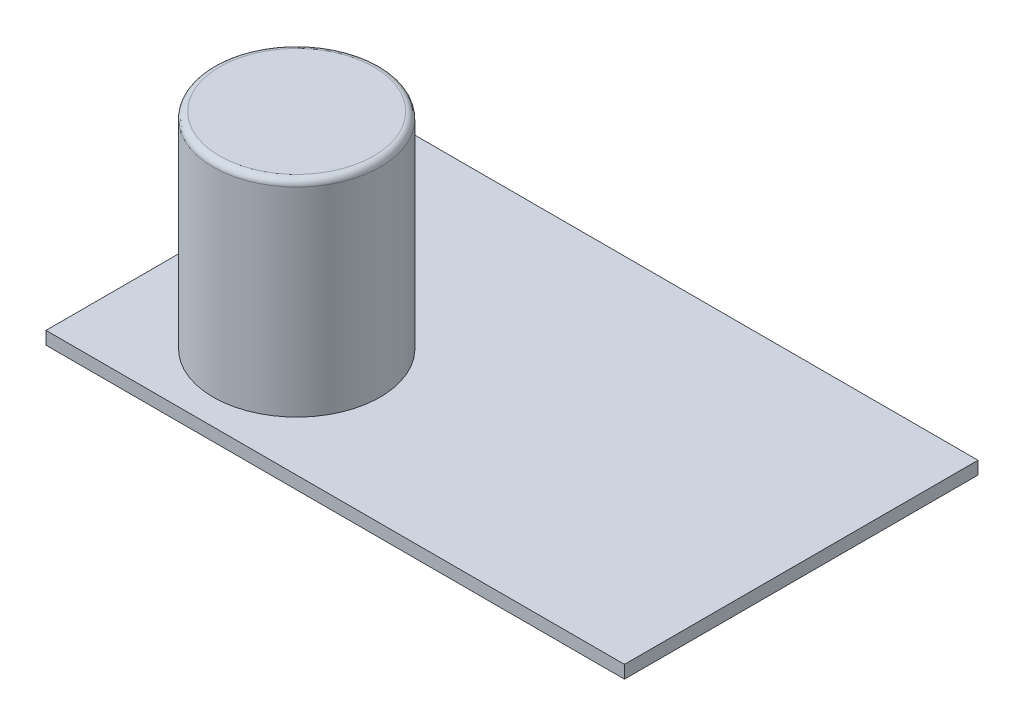
ISO-10303-21;
HEADER;
FILE_DESCRIPTION(('STEP AP214'),'2;1');
FILE_NAME('part.step','',(''),(''),'','','');
FILE_SCHEMA(('AUTOMOTIVE_DESIGN { 1 0 10303 214 1 1 1 1 }'));
ENDSEC;
DATA;
#1=APPLICATION_CONTEXT('core data for automotive mechanical design processes');
#2=APPLICATION_PROTOCOL_DEFINITION('international standard','automotive_design',2000,#1);
#3=PRODUCT_CONTEXT('',#1,'mechanical');
#4=PRODUCT('Part','Part','',(#3));
#5=PRODUCT_RELATED_PRODUCT_CATEGORY('part','',(#4));
#6=PRODUCT_DEFINITION_FORMATION('','',#4);
#7=PRODUCT_DEFINITION_CONTEXT('part definition',#1,'design');
#8=PRODUCT_DEFINITION('design','',#6,#7);
#9=PRODUCT_DEFINITION_SHAPE('','',#8);
#10=(LENGTH_UNIT() NAMED_UNIT(*) SI_UNIT(.MILLI.,.METRE.));
#11=(NAMED_UNIT(*) PLANE_ANGLE_UNIT() SI_UNIT($,.RADIAN.));
#12=(NAMED_UNIT(*) SI_UNIT($,.STERADIAN.) SOLID_ANGLE_UNIT());
#13=UNCERTAINTY_MEASURE_WITH_UNIT(LENGTH_MEASURE(1.E-05),#10,'distance_accuracy_value','');
#14=(GEOMETRIC_REPRESENTATION_CONTEXT(3) GLOBAL_UNCERTAINTY_ASSIGNED_CONTEXT((#13)) GLOBAL_UNIT_ASSIGNED_CONTEXT((#10,
#11,#12)) REPRESENTATION_CONTEXT('',''));
#15=CARTESIAN_POINT('',(0.,0.,0.));
#16=DIRECTION('',(0.,0.,1.));
#17=DIRECTION('',(1.,0.,0.));
#18=AXIS2_PLACEMENT_3D('',#15,#16,#17);
#19=CARTESIAN_POINT('',(11.,17.,-8.5));
#20=DIRECTION('',(0.,-1.,0.));
#21=DIRECTION('',(0.,0.,-1.));
#22=AXIS2_PLACEMENT_3D('',#19,#20,#21);
#23=CYLINDRICAL_SURFACE('',#22,6.5);
#24=CARTESIAN_POINT('',(11.,16.5,-8.5));
#25=DIRECTION('',(0.,1.,0.));
#26=DIRECTION('',(0.,0.,1.));
#27=AXIS2_PLACEMENT_3D('',#24,#25,#26);
#28=CIRCLE('',#27,6.5);
#29=CARTESIAN_POINT('',(11.,16.5,-2.));
#30=VERTEX_POINT('',#29);
#31=EDGE_CURVE('E11',#30,#30,#28,.F.);
#32=ORIENTED_EDGE('',*,*,#31,.T.);
#33=EDGE_LOOP('',(#32));
#34=FACE_BOUND('',#33,.T.);
#35=CARTESIAN_POINT('',(11.,1.,-8.5));
#36=DIRECTION('',(0.,1.,0.));
#37=DIRECTION('',(0.,0.,1.));
#38=AXIS2_PLACEMENT_3D('',#35,#36,#37);
#39=CIRCLE('',#38,6.5);
#40=CARTESIAN_POINT('',(11.,1.,-2.));
#41=VERTEX_POINT('',#40);
#42=EDGE_CURVE('E57',#41,#41,#39,.T.);
#43=ORIENTED_EDGE('',*,*,#42,.T.);
#44=EDGE_LOOP('',(#43));
#45=FACE_BOUND('',#44,.T.);
#46=ADVANCED_FACE('F46',(#34,#45),#23,.T.);
#47=CARTESIAN_POINT('',(11.,17.,-8.5));
#48=DIRECTION('',(0.,1.,0.));
#49=DIRECTION('',(0.,0.,1.));
#50=AXIS2_PLACEMENT_3D('',#47,#48,#49);
#51=PLANE('',#50);
#52=CARTESIAN_POINT('',(11.,17.,-8.5));
#53=DIRECTION('',(0.,1.,0.));
#54=DIRECTION('',(0.,0.,1.));
#55=AXIS2_PLACEMENT_3D('',#52,#53,#54);
#56=CIRCLE('',#55,6.);
#57=CARTESIAN_POINT('',(11.,17.,-2.5));
#58=VERTEX_POINT('',#57);
#59=EDGE_CURVE('E53',#58,#58,#56,.T.);
#60=ORIENTED_EDGE('',*,*,#59,.T.);
#61=EDGE_LOOP('',(#60));
#62=FACE_BOUND('',#61,.T.);
#63=ADVANCED_FACE('F67',(#62),#51,.T.);
#64=CARTESIAN_POINT('',(11.,1.,-8.5));
#65=DIRECTION('',(0.,1.,0.));
#66=DIRECTION('',(0.,0.,1.));
#67=AXIS2_PLACEMENT_3D('',#64,#65,#66);
#68=PLANE('',#67);
#69=ORIENTED_EDGE('',*,*,#42,.F.);
#70=EDGE_LOOP('',(#69));
#71=FACE_BOUND('',#70,.T.);
#72=ADVANCED_FACE('F65',(#71),#68,.F.);
#73=CARTESIAN_POINT('',(11.,16.5,-8.5));
#74=DIRECTION('',(0.,1.,0.));
#75=DIRECTION('',(0.,0.,1.));
#76=AXIS2_PLACEMENT_3D('',#73,#74,#75);
#77=TOROIDAL_SURFACE('',#76,6.,0.5);
#78=ORIENTED_EDGE('',*,*,#31,.F.);
#79=EDGE_LOOP('',(#78));
#80=FACE_BOUND('',#79,.T.);
#81=ORIENTED_EDGE('',*,*,#59,.F.);
#82=EDGE_LOOP('',(#81));
#83=FACE_BOUND('',#82,.T.);
#84=ADVANCED_FACE('F48',(#80,#83),#77,.T.);
#85=CLOSED_SHELL('',(#46,#63,#72,#84));
#86=MANIFOLD_SOLID_BREP('B2',#85);
#87=CARTESIAN_POINT('',(0.,1.,0.));
#88=DIRECTION('',(1.,0.,0.));
#89=DIRECTION('',(0.,0.,-1.));
#90=AXIS2_PLACEMENT_3D('',#87,#88,#89);
#91=PLANE('',#90);
#92=DIRECTION('',(0.,0.,1.));
#93=VECTOR('',#92,1.);
#94=CARTESIAN_POINT('',(0.,0.,0.));
#95=LINE('',#94,#93);
#96=CARTESIAN_POINT('',(0.,0.,-27.5));
#97=VERTEX_POINT('',#96);
#98=CARTESIAN_POINT('',(0.,0.,0.));
#99=VERTEX_POINT('',#98);
#100=EDGE_CURVE('E164',#97,#99,#95,.T.);
#101=ORIENTED_EDGE('',*,*,#100,.T.);
#102=DIRECTION('',(0.,-1.,0.));
#103=VECTOR('',#102,1.);
#104=CARTESIAN_POINT('',(0.,1.,0.));
#105=LINE('',#104,#103);
#106=CARTESIAN_POINT('',(0.,1.,0.));
#107=VERTEX_POINT('',#106);
#108=EDGE_CURVE('E44',#107,#99,#105,.T.);
#109=ORIENTED_EDGE('',*,*,#108,.F.);
#110=DIRECTION('',(0.,0.,1.));
#111=VECTOR('',#110,1.);
#112=CARTESIAN_POINT('',(0.,1.,0.));
#113=LINE('',#112,#111);
#114=CARTESIAN_POINT('',(0.,1.,-27.5));
#115=VERTEX_POINT('',#114);
#116=EDGE_CURVE('E152',#115,#107,#113,.T.);
#117=ORIENTED_EDGE('',*,*,#116,.F.);
#118=DIRECTION('',(0.,-1.,0.));
#119=VECTOR('',#118,1.);
#120=CARTESIAN_POINT('',(0.,1.,-27.5));
#121=LINE('',#120,#119);
#122=EDGE_CURVE('E160',#115,#97,#121,.T.);
#123=ORIENTED_EDGE('',*,*,#122,.T.);
#124=EDGE_LOOP('',(#101,#109,#117,#123));
#125=FACE_BOUND('',#124,.T.);
#126=ADVANCED_FACE('F101',(#125),#91,.F.);
#127=CARTESIAN_POINT('',(0.,1.,0.));
#128=DIRECTION('',(0.,0.,-1.));
#129=DIRECTION('',(-1.,0.,0.));
#130=AXIS2_PLACEMENT_3D('',#127,#128,#129);
#131=PLANE('',#130);
#132=DIRECTION('',(1.,0.,0.));
#133=VECTOR('',#132,1.);
#134=CARTESIAN_POINT('',(0.,0.,0.));
#135=LINE('',#134,#133);
#136=CARTESIAN_POINT('',(45.,0.,0.));
#137=VERTEX_POINT('',#136);
#138=EDGE_CURVE('E156',#99,#137,#135,.T.);
#139=ORIENTED_EDGE('',*,*,#138,.T.);
#140=DIRECTION('',(0.,-1.,0.));
#141=VECTOR('',#140,1.);
#142=CARTESIAN_POINT('',(45.,1.,0.));
#143=LINE('',#142,#141);
#144=CARTESIAN_POINT('',(45.,1.,0.));
#145=VERTEX_POINT('',#144);
#146=EDGE_CURVE('E109',#145,#137,#143,.T.);
#147=ORIENTED_EDGE('',*,*,#146,.F.);
#148=DIRECTION('',(1.,0.,0.));
#149=VECTOR('',#148,1.);
#150=CARTESIAN_POINT('',(0.,1.,0.));
#151=LINE('',#150,#149);
#152=EDGE_CURVE('E147',#107,#145,#151,.T.);
#153=ORIENTED_EDGE('',*,*,#152,.F.);
#154=ORIENTED_EDGE('',*,*,#108,.T.);
#155=EDGE_LOOP('',(#139,#147,#153,#154));
#156=FACE_BOUND('',#155,.T.);
#157=ADVANCED_FACE('F155',(#156),#131,.F.);
#158=CARTESIAN_POINT('',(45.,1.,0.));
#159=DIRECTION('',(-1.,0.,0.));
#160=DIRECTION('',(0.,0.,1.));
#161=AXIS2_PLACEMENT_3D('',#158,#159,#160);
#162=PLANE('',#161);
#163=DIRECTION('',(0.,0.,-1.));
#164=VECTOR('',#163,1.);
#165=CARTESIAN_POINT('',(45.,0.,0.));
#166=LINE('',#165,#164);
#167=CARTESIAN_POINT('',(45.,0.,-27.5));
#168=VERTEX_POINT('',#167);
#169=EDGE_CURVE('E134',#137,#168,#166,.T.);
#170=ORIENTED_EDGE('',*,*,#169,.T.);
#171=DIRECTION('',(0.,-1.,0.));
#172=VECTOR('',#171,1.);
#173=CARTESIAN_POINT('',(45.,1.,-27.5));
#174=LINE('',#173,#172);
#175=CARTESIAN_POINT('',(45.,1.,-27.5));
#176=VERTEX_POINT('',#175);
#177=EDGE_CURVE('E157',#176,#168,#174,.T.);
#178=ORIENTED_EDGE('',*,*,#177,.F.);
#179=DIRECTION('',(0.,0.,-1.));
#180=VECTOR('',#179,1.);
#181=CARTESIAN_POINT('',(45.,1.,0.));
#182=LINE('',#181,#180);
#183=EDGE_CURVE('E150',#145,#176,#182,.T.);
#184=ORIENTED_EDGE('',*,*,#183,.F.);
#185=ORIENTED_EDGE('',*,*,#146,.T.);
#186=EDGE_LOOP('',(#170,#178,#184,#185));
#187=FACE_BOUND('',#186,.T.);
#188=ADVANCED_FACE('F158',(#187),#162,.F.);
#189=CARTESIAN_POINT('',(0.,1.,-27.5));
#190=DIRECTION('',(0.,0.,1.));
#191=DIRECTION('',(1.,0.,0.));
#192=AXIS2_PLACEMENT_3D('',#189,#190,#191);
#193=PLANE('',#192);
#194=DIRECTION('',(-1.,0.,0.));
#195=VECTOR('',#194,1.);
#196=CARTESIAN_POINT('',(0.,0.,-27.5));
#197=LINE('',#196,#195);
#198=EDGE_CURVE('E140',#168,#97,#197,.T.);
#199=ORIENTED_EDGE('',*,*,#198,.T.);
#200=ORIENTED_EDGE('',*,*,#122,.F.);
#201=DIRECTION('',(-1.,0.,0.));
#202=VECTOR('',#201,1.);
#203=CARTESIAN_POINT('',(0.,1.,-27.5));
#204=LINE('',#203,#202);
#205=EDGE_CURVE('E117',#176,#115,#204,.T.);
#206=ORIENTED_EDGE('',*,*,#205,.F.);
#207=ORIENTED_EDGE('',*,*,#177,.T.);
#208=EDGE_LOOP('',(#199,#200,#206,#207));
#209=FACE_BOUND('',#208,.T.);
#210=ADVANCED_FACE('F171',(#209),#193,.F.);
#211=CARTESIAN_POINT('',(0.,1.,0.));
#212=DIRECTION('',(0.,-1.,0.));
#213=DIRECTION('',(0.,0.,-1.));
#214=AXIS2_PLACEMENT_3D('',#211,#212,#213);
#215=PLANE('',#214);
#216=ORIENTED_EDGE('',*,*,#116,.T.);
#217=ORIENTED_EDGE('',*,*,#152,.T.);
#218=ORIENTED_EDGE('',*,*,#183,.T.);
#219=ORIENTED_EDGE('',*,*,#205,.T.);
#220=EDGE_LOOP('',(#216,#217,#218,#219));
#221=FACE_BOUND('',#220,.T.);
#222=ADVANCED_FACE('F148',(#221),#215,.F.);
#223=CARTESIAN_POINT('',(0.,0.,0.));
#224=DIRECTION('',(0.,-1.,0.));
#225=DIRECTION('',(0.,0.,-1.));
#226=AXIS2_PLACEMENT_3D('',#223,#224,#225);
#227=PLANE('',#226);
#228=ORIENTED_EDGE('',*,*,#100,.F.);
#229=ORIENTED_EDGE('',*,*,#198,.F.);
#230=ORIENTED_EDGE('',*,*,#169,.F.);
#231=ORIENTED_EDGE('',*,*,#138,.F.);
#232=EDGE_LOOP('',(#228,#229,#230,#231));
#233=FACE_BOUND('',#232,.T.);
#234=ADVANCED_FACE('F174',(#233),#227,.T.);
#235=CLOSED_SHELL('',(#126,#157,#188,#210,#222,#234));
#236=MANIFOLD_SOLID_BREP('B6',#235);
#237=ADVANCED_BREP_SHAPE_REPRESENTATION('',(#18,#86,#236),#14);
#238=SHAPE_DEFINITION_REPRESENTATION(#9,#237);
ENDSEC;
END-ISO-10303-21;
